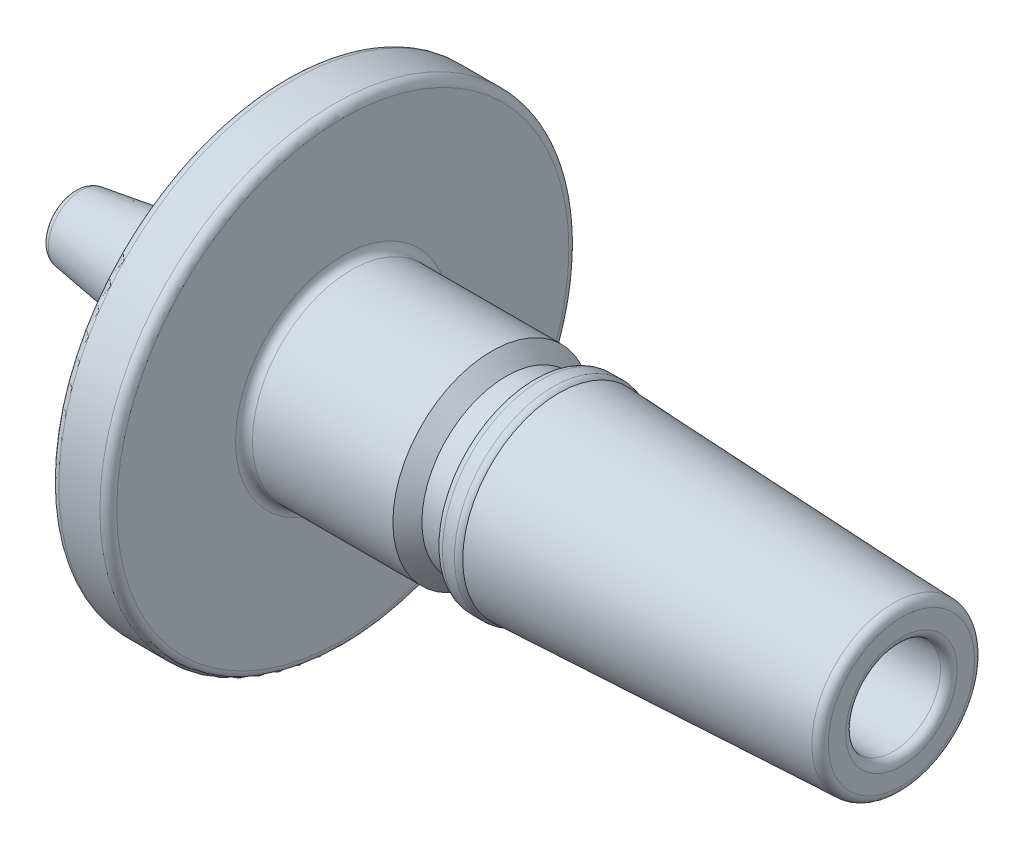
ISO-10303-21;
HEADER;
FILE_DESCRIPTION(('STEP AP214'),'2;1');
FILE_NAME('part.step','',(''),(''),'','','');
FILE_SCHEMA(('AUTOMOTIVE_DESIGN { 1 0 10303 214 1 1 1 1 }'));
ENDSEC;
DATA;
#1=APPLICATION_CONTEXT('core data for automotive mechanical design processes');
#2=APPLICATION_PROTOCOL_DEFINITION('international standard','automotive_design',2000,#1);
#3=PRODUCT_CONTEXT('',#1,'mechanical');
#4=PRODUCT('Part','Part','',(#3));
#5=PRODUCT_RELATED_PRODUCT_CATEGORY('part','',(#4));
#6=PRODUCT_DEFINITION_FORMATION('','',#4);
#7=PRODUCT_DEFINITION_CONTEXT('part definition',#1,'design');
#8=PRODUCT_DEFINITION('design','',#6,#7);
#9=PRODUCT_DEFINITION_SHAPE('','',#8);
#10=(LENGTH_UNIT() NAMED_UNIT(*) SI_UNIT(.MILLI.,.METRE.));
#11=(NAMED_UNIT(*) PLANE_ANGLE_UNIT() SI_UNIT($,.RADIAN.));
#12=(NAMED_UNIT(*) SI_UNIT($,.STERADIAN.) SOLID_ANGLE_UNIT());
#13=UNCERTAINTY_MEASURE_WITH_UNIT(LENGTH_MEASURE(1.E-05),#10,'distance_accuracy_value','');
#14=(GEOMETRIC_REPRESENTATION_CONTEXT(3) GLOBAL_UNCERTAINTY_ASSIGNED_CONTEXT((#13)) GLOBAL_UNIT_ASSIGNED_CONTEXT((#10,
#11,#12)) REPRESENTATION_CONTEXT('',''));
#15=CARTESIAN_POINT('',(0.,0.,0.));
#16=DIRECTION('',(0.,0.,1.));
#17=DIRECTION('',(1.,0.,0.));
#18=AXIS2_PLACEMENT_3D('',#15,#16,#17);
#19=CARTESIAN_POINT('',(1.397,0.,-0.635));
#20=DIRECTION('',(-1.,0.,0.));
#21=DIRECTION('',(0.,0.,1.));
#22=AXIS2_PLACEMENT_3D('',#19,#20,#21);
#23=PLANE('',#22);
#24=CARTESIAN_POINT('',(1.397,0.,0.));
#25=DIRECTION('',(-1.,0.,0.));
#26=DIRECTION('',(0.,0.,1.));
#27=AXIS2_PLACEMENT_3D('',#24,#25,#26);
#28=CIRCLE('',#27,0.908019915936334);
#29=CARTESIAN_POINT('',(1.397,0.,0.908019915936334));
#30=VERTEX_POINT('',#29);
#31=EDGE_CURVE('E109',#30,#30,#28,.T.);
#32=ORIENTED_EDGE('',*,*,#31,.F.);
#33=EDGE_LOOP('',(#32));
#34=FACE_BOUND('',#33,.T.);
#35=CARTESIAN_POINT('',(1.397,0.,0.));
#36=DIRECTION('',(-1.,0.,0.));
#37=DIRECTION('',(0.,0.,1.));
#38=AXIS2_PLACEMENT_3D('',#35,#36,#37);
#39=CIRCLE('',#38,0.635);
#40=CARTESIAN_POINT('',(1.397,0.,0.635));
#41=VERTEX_POINT('',#40);
#42=EDGE_CURVE('E133',#41,#41,#39,.T.);
#43=ORIENTED_EDGE('',*,*,#42,.T.);
#44=EDGE_LOOP('',(#43));
#45=FACE_BOUND('',#44,.T.);
#46=ADVANCED_FACE('F47',(#34,#45),#23,.F.);
#47=CARTESIAN_POINT('',(1.397,0.,0.));
#48=DIRECTION('',(1.,0.,0.));
#49=DIRECTION('',(0.,0.,-1.));
#50=AXIS2_PLACEMENT_3D('',#47,#48,#49);
#51=CONICAL_SURFACE('',#50,0.908019915936334,0.0174532925199434);
#52=CARTESIAN_POINT('',(14.659346328988,0.,0.));
#53=DIRECTION('',(-1.,0.,0.));
#54=DIRECTION('',(0.,0.,1.));
#55=AXIS2_PLACEMENT_3D('',#52,#53,#54);
#56=CIRCLE('',#55,1.13951503220933);
#57=CARTESIAN_POINT('',(14.659346328988,0.,1.13951503220933));
#58=VERTEX_POINT('',#57);
#59=EDGE_CURVE('E100',#58,#58,#56,.F.);
#60=ORIENTED_EDGE('',*,*,#59,.T.);
#61=EDGE_LOOP('',(#60));
#62=FACE_BOUND('',#61,.T.);
#63=ORIENTED_EDGE('',*,*,#31,.T.);
#64=EDGE_LOOP('',(#63));
#65=FACE_BOUND('',#64,.T.);
#66=ADVANCED_FACE('F164',(#62,#65),#51,.F.);
#67=CARTESIAN_POINT('',(14.859,0.,-1.143));
#68=DIRECTION('',(-1.,0.,0.));
#69=DIRECTION('',(0.,0.,1.));
#70=AXIS2_PLACEMENT_3D('',#67,#68,#69);
#71=PLANE('',#70);
#72=CARTESIAN_POINT('',(14.859,0.,0.));
#73=DIRECTION('',(-1.,0.,0.));
#74=DIRECTION('',(0.,0.,1.));
#75=AXIS2_PLACEMENT_3D('',#72,#73,#74);
#76=CIRCLE('',#75,1.34268408386511);
#77=CARTESIAN_POINT('',(14.859,0.,1.34268408386511));
#78=VERTEX_POINT('',#77);
#79=EDGE_CURVE('E103',#78,#78,#76,.T.);
#80=ORIENTED_EDGE('',*,*,#79,.T.);
#81=EDGE_LOOP('',(#80));
#82=FACE_BOUND('',#81,.T.);
#83=CARTESIAN_POINT('',(14.859,0.,0.));
#84=DIRECTION('',(-1.,0.,0.));
#85=DIRECTION('',(0.,0.,1.));
#86=AXIS2_PLACEMENT_3D('',#83,#84,#85);
#87=CIRCLE('',#86,1.76127831797382);
#88=CARTESIAN_POINT('',(14.859,0.,1.76127831797382));
#89=VERTEX_POINT('',#88);
#90=EDGE_CURVE('E106',#89,#89,#87,.F.);
#91=ORIENTED_EDGE('',*,*,#90,.T.);
#92=EDGE_LOOP('',(#91));
#93=FACE_BOUND('',#92,.T.);
#94=ADVANCED_FACE('F170',(#82,#93),#71,.F.);
#95=CARTESIAN_POINT('',(14.859,0.,0.));
#96=DIRECTION('',(-1.,0.,0.));
#97=DIRECTION('',(0.,0.,1.));
#98=AXIS2_PLACEMENT_3D('',#95,#96,#97);
#99=CONICAL_SURFACE('',#98,1.9558,0.043633231299851);
#100=CARTESIAN_POINT('',(14.6646634595126,0.,0.));
#101=DIRECTION('',(1.,0.,0.));
#102=DIRECTION('',(0.,0.,-1.));
#103=AXIS2_PLACEMENT_3D('',#100,#101,#102);
#104=CIRCLE('',#103,1.96428491659925);
#105=CARTESIAN_POINT('',(14.6646634595126,0.,-1.96428491659925));
#106=VERTEX_POINT('',#105);
#107=EDGE_CURVE('E88',#106,#106,#104,.F.);
#108=ORIENTED_EDGE('',*,*,#107,.T.);
#109=EDGE_LOOP('',(#108));
#110=FACE_BOUND('',#109,.T.);
#111=CARTESIAN_POINT('',(6.604,0.,0.));
#112=DIRECTION('',(-1.,0.,0.));
#113=DIRECTION('',(0.,0.,1.));
#114=AXIS2_PLACEMENT_3D('',#111,#112,#113);
#115=CIRCLE('',#114,2.31622108370971);
#116=CARTESIAN_POINT('',(6.604,0.,2.31622108370971));
#117=VERTEX_POINT('',#116);
#118=EDGE_CURVE('E112',#117,#117,#115,.T.);
#119=ORIENTED_EDGE('',*,*,#118,.F.);
#120=EDGE_LOOP('',(#119));
#121=FACE_BOUND('',#120,.T.);
#122=ADVANCED_FACE('F214',(#110,#121),#99,.T.);
#123=CARTESIAN_POINT('',(0.,0.,0.));
#124=DIRECTION('',(-1.,0.,0.));
#125=DIRECTION('',(0.,0.,1.));
#126=AXIS2_PLACEMENT_3D('',#123,#124,#125);
#127=CYLINDRICAL_SURFACE('',#126,2.3749);
#128=CARTESIAN_POINT('',(6.46115779208031,0.,0.));
#129=DIRECTION('',(1.,0.,0.));
#130=DIRECTION('',(0.,0.,-1.));
#131=AXIS2_PLACEMENT_3D('',#128,#129,#130);
#132=CIRCLE('',#131,2.3749);
#133=CARTESIAN_POINT('',(6.46115779208031,0.,-2.3749));
#134=VERTEX_POINT('',#133);
#135=EDGE_CURVE('E94',#134,#134,#132,.F.);
#136=ORIENTED_EDGE('',*,*,#135,.T.);
#137=EDGE_LOOP('',(#136));
#138=FACE_BOUND('',#137,.T.);
#139=CARTESIAN_POINT('',(6.1722,0.,0.));
#140=DIRECTION('',(1.,0.,0.));
#141=DIRECTION('',(0.,0.,-1.));
#142=AXIS2_PLACEMENT_3D('',#139,#140,#141);
#143=CIRCLE('',#142,2.3749);
#144=CARTESIAN_POINT('',(6.1722,0.,-2.3749));
#145=VERTEX_POINT('',#144);
#146=EDGE_CURVE('E97',#145,#145,#143,.T.);
#147=ORIENTED_EDGE('',*,*,#146,.T.);
#148=EDGE_LOOP('',(#147));
#149=FACE_BOUND('',#148,.T.);
#150=ADVANCED_FACE('F195',(#138,#149),#127,.T.);
#151=CARTESIAN_POINT('',(5.969,0.,-2.3749));
#152=DIRECTION('',(1.,0.,0.));
#153=DIRECTION('',(0.,0.,-1.));
#154=AXIS2_PLACEMENT_3D('',#151,#152,#153);
#155=PLANE('',#154);
#156=CARTESIAN_POINT('',(5.969,0.,0.));
#157=DIRECTION('',(1.,0.,0.));
#158=DIRECTION('',(0.,0.,-1.));
#159=AXIS2_PLACEMENT_3D('',#156,#157,#158);
#160=CIRCLE('',#159,2.1717);
#161=CARTESIAN_POINT('',(5.969,0.,-2.1717));
#162=VERTEX_POINT('',#161);
#163=EDGE_CURVE('E91',#162,#162,#160,.F.);
#164=ORIENTED_EDGE('',*,*,#163,.T.);
#165=EDGE_LOOP('',(#164));
#166=FACE_BOUND('',#165,.T.);
#167=CARTESIAN_POINT('',(5.969,0.,0.));
#168=DIRECTION('',(-1.,0.,0.));
#169=DIRECTION('',(0.,0.,1.));
#170=AXIS2_PLACEMENT_3D('',#167,#168,#169);
#171=CIRCLE('',#170,2.032);
#172=CARTESIAN_POINT('',(5.969,0.,2.032));
#173=VERTEX_POINT('',#172);
#174=EDGE_CURVE('E115',#173,#173,#171,.T.);
#175=ORIENTED_EDGE('',*,*,#174,.F.);
#176=EDGE_LOOP('',(#175));
#177=FACE_BOUND('',#176,.T.);
#178=ADVANCED_FACE('F191',(#166,#177),#155,.F.);
#179=CARTESIAN_POINT('',(0.,0.,0.));
#180=DIRECTION('',(-1.,0.,0.));
#181=DIRECTION('',(0.,0.,1.));
#182=AXIS2_PLACEMENT_3D('',#179,#180,#181);
#183=CYLINDRICAL_SURFACE('',#182,2.032);
#184=CARTESIAN_POINT('',(5.334,0.,0.));
#185=DIRECTION('',(-1.,0.,0.));
#186=DIRECTION('',(0.,0.,1.));
#187=AXIS2_PLACEMENT_3D('',#184,#185,#186);
#188=CIRCLE('',#187,2.032);
#189=CARTESIAN_POINT('',(5.334,0.,2.032));
#190=VERTEX_POINT('',#189);
#191=EDGE_CURVE('E118',#190,#190,#188,.T.);
#192=ORIENTED_EDGE('',*,*,#191,.F.);
#193=EDGE_LOOP('',(#192));
#194=FACE_BOUND('',#193,.T.);
#195=ORIENTED_EDGE('',*,*,#174,.T.);
#196=EDGE_LOOP('',(#195));
#197=FACE_BOUND('',#196,.T.);
#198=ADVANCED_FACE('F194',(#194,#197),#183,.T.);
#199=CARTESIAN_POINT('',(5.334,0.,0.));
#200=DIRECTION('',(-1.,0.,0.));
#201=DIRECTION('',(0.,0.,1.));
#202=AXIS2_PLACEMENT_3D('',#199,#200,#201);
#203=CONICAL_SURFACE('',#202,2.032,0.785398163397451);
#204=CARTESIAN_POINT('',(4.98475,0.,0.));
#205=DIRECTION('',(-1.,0.,0.));
#206=DIRECTION('',(0.,0.,1.));
#207=AXIS2_PLACEMENT_3D('',#204,#205,#206);
#208=CIRCLE('',#207,2.38125);
#209=CARTESIAN_POINT('',(4.98475,0.,2.38125));
#210=VERTEX_POINT('',#209);
#211=EDGE_CURVE('E121',#210,#210,#208,.T.);
#212=ORIENTED_EDGE('',*,*,#211,.F.);
#213=EDGE_LOOP('',(#212));
#214=FACE_BOUND('',#213,.T.);
#215=ORIENTED_EDGE('',*,*,#191,.T.);
#216=EDGE_LOOP('',(#215));
#217=FACE_BOUND('',#216,.T.);
#218=ADVANCED_FACE('F200',(#214,#217),#203,.T.);
#219=CARTESIAN_POINT('',(0.,0.,0.));
#220=DIRECTION('',(-1.,0.,0.));
#221=DIRECTION('',(0.,0.,1.));
#222=AXIS2_PLACEMENT_3D('',#219,#220,#221);
#223=CYLINDRICAL_SURFACE('',#222,2.38125);
#224=CARTESIAN_POINT('',(1.6002,0.,0.));
#225=DIRECTION('',(-1.,0.,0.));
#226=DIRECTION('',(0.,0.,1.));
#227=AXIS2_PLACEMENT_3D('',#224,#225,#226);
#228=CIRCLE('',#227,2.38125);
#229=CARTESIAN_POINT('',(1.6002,0.,2.38125));
#230=VERTEX_POINT('',#229);
#231=EDGE_CURVE('E12',#230,#230,#228,.F.);
#232=ORIENTED_EDGE('',*,*,#231,.T.);
#233=EDGE_LOOP('',(#232));
#234=FACE_BOUND('',#233,.T.);
#235=ORIENTED_EDGE('',*,*,#211,.T.);
#236=EDGE_LOOP('',(#235));
#237=FACE_BOUND('',#236,.T.);
#238=ADVANCED_FACE('F206',(#234,#237),#223,.T.);
#239=CARTESIAN_POINT('',(1.397,0.,-2.38125));
#240=DIRECTION('',(-1.,0.,0.));
#241=DIRECTION('',(0.,0.,1.));
#242=AXIS2_PLACEMENT_3D('',#239,#240,#241);
#243=PLANE('',#242);
#244=CARTESIAN_POINT('',(1.397,0.,0.));
#245=DIRECTION('',(-1.,0.,0.));
#246=DIRECTION('',(0.,0.,1.));
#247=AXIS2_PLACEMENT_3D('',#244,#245,#246);
#248=CIRCLE('',#247,2.58445);
#249=CARTESIAN_POINT('',(1.397,0.,2.58445));
#250=VERTEX_POINT('',#249);
#251=EDGE_CURVE('E54',#250,#250,#248,.T.);
#252=ORIENTED_EDGE('',*,*,#251,.T.);
#253=EDGE_LOOP('',(#252));
#254=FACE_BOUND('',#253,.T.);
#255=CARTESIAN_POINT('',(1.397,0.,0.));
#256=DIRECTION('',(-1.,0.,0.));
#257=DIRECTION('',(0.,0.,1.));
#258=AXIS2_PLACEMENT_3D('',#255,#256,#257);
#259=CIRCLE('',#258,5.4483);
#260=CARTESIAN_POINT('',(1.397,0.,5.4483));
#261=VERTEX_POINT('',#260);
#262=EDGE_CURVE('E58',#261,#261,#259,.F.);
#263=ORIENTED_EDGE('',*,*,#262,.T.);
#264=EDGE_LOOP('',(#263));
#265=FACE_BOUND('',#264,.T.);
#266=ADVANCED_FACE('F257',(#254,#265),#243,.F.);
#267=CARTESIAN_POINT('',(0.,0.,0.));
#268=DIRECTION('',(-1.,0.,0.));
#269=DIRECTION('',(0.,0.,1.));
#270=AXIS2_PLACEMENT_3D('',#267,#268,#269);
#271=CYLINDRICAL_SURFACE('',#270,5.6515);
#272=CARTESIAN_POINT('',(0.2032,0.,0.));
#273=DIRECTION('',(1.,0.,0.));
#274=DIRECTION('',(0.,0.,-1.));
#275=AXIS2_PLACEMENT_3D('',#272,#273,#274);
#276=CIRCLE('',#275,5.6515);
#277=CARTESIAN_POINT('',(0.2032,0.,-5.6515));
#278=VERTEX_POINT('',#277);
#279=EDGE_CURVE('E62',#278,#278,#276,.T.);
#280=ORIENTED_EDGE('',*,*,#279,.T.);
#281=EDGE_LOOP('',(#280));
#282=FACE_BOUND('',#281,.T.);
#283=CARTESIAN_POINT('',(1.1938,0.,0.));
#284=DIRECTION('',(-1.,0.,0.));
#285=DIRECTION('',(0.,0.,1.));
#286=AXIS2_PLACEMENT_3D('',#283,#284,#285);
#287=CIRCLE('',#286,5.6515);
#288=CARTESIAN_POINT('',(1.1938,0.,5.6515));
#289=VERTEX_POINT('',#288);
#290=EDGE_CURVE('E67',#289,#289,#287,.T.);
#291=ORIENTED_EDGE('',*,*,#290,.T.);
#292=EDGE_LOOP('',(#291));
#293=FACE_BOUND('',#292,.T.);
#294=ADVANCED_FACE('F266',(#282,#293),#271,.T.);
#295=CARTESIAN_POINT('',(0.,0.,-5.6515));
#296=DIRECTION('',(1.,0.,0.));
#297=DIRECTION('',(0.,0.,-1.));
#298=AXIS2_PLACEMENT_3D('',#295,#296,#297);
#299=PLANE('',#298);
#300=CARTESIAN_POINT('',(0.,0.,0.));
#301=DIRECTION('',(1.,0.,0.));
#302=DIRECTION('',(0.,0.,-1.));
#303=AXIS2_PLACEMENT_3D('',#300,#301,#302);
#304=CIRCLE('',#303,1.31799328390815);
#305=CARTESIAN_POINT('',(0.,0.,-1.31799328390815));
#306=VERTEX_POINT('',#305);
#307=EDGE_CURVE('E70',#306,#306,#304,.T.);
#308=ORIENTED_EDGE('',*,*,#307,.T.);
#309=EDGE_LOOP('',(#308));
#310=FACE_BOUND('',#309,.T.);
#311=CARTESIAN_POINT('',(0.,0.,0.));
#312=DIRECTION('',(1.,0.,0.));
#313=DIRECTION('',(0.,0.,-1.));
#314=AXIS2_PLACEMENT_3D('',#311,#312,#313);
#315=CIRCLE('',#314,5.4483);
#316=CARTESIAN_POINT('',(0.,0.,-5.4483));
#317=VERTEX_POINT('',#316);
#318=EDGE_CURVE('E73',#317,#317,#315,.F.);
#319=ORIENTED_EDGE('',*,*,#318,.T.);
#320=EDGE_LOOP('',(#319));
#321=FACE_BOUND('',#320,.T.);
#322=ADVANCED_FACE('F275',(#310,#321),#299,.F.);
#323=CARTESIAN_POINT('',(0.,0.,0.));
#324=DIRECTION('',(1.,0.,0.));
#325=DIRECTION('',(0.,0.,-1.));
#326=AXIS2_PLACEMENT_3D('',#323,#324,#325);
#327=CONICAL_SURFACE('',#326,1.143,0.148889947609497);
#328=CARTESIAN_POINT('',(-1.25501244601892,0.,0.));
#329=DIRECTION('',(1.,0.,0.));
#330=DIRECTION('',(0.,0.,-1.));
#331=AXIS2_PLACEMENT_3D('',#328,#329,#330);
#332=CIRCLE('',#331,0.954748133097162);
#333=CARTESIAN_POINT('',(-1.25501244601892,0.,-0.954748133097162));
#334=VERTEX_POINT('',#333);
#335=EDGE_CURVE('E76',#334,#334,#332,.T.);
#336=ORIENTED_EDGE('',*,*,#335,.T.);
#337=EDGE_LOOP('',(#336));
#338=FACE_BOUND('',#337,.T.);
#339=CARTESIAN_POINT('',(-0.173057219964574,0.,0.));
#340=DIRECTION('',(1.,0.,0.));
#341=DIRECTION('',(0.,0.,-1.));
#342=AXIS2_PLACEMENT_3D('',#339,#340,#341);
#343=CIRCLE('',#342,1.11704141700531);
#344=CARTESIAN_POINT('',(-0.173057219964574,0.,-1.11704141700531));
#345=VERTEX_POINT('',#344);
#346=EDGE_CURVE('E79',#345,#345,#343,.F.);
#347=ORIENTED_EDGE('',*,*,#346,.T.);
#348=EDGE_LOOP('',(#347));
#349=FACE_BOUND('',#348,.T.);
#350=ADVANCED_FACE('F285',(#338,#349),#327,.T.);
#351=CARTESIAN_POINT('',(0.,0.,0.));
#352=DIRECTION('',(-1.,0.,0.));
#353=DIRECTION('',(0.,0.,1.));
#354=AXIS2_PLACEMENT_3D('',#351,#352,#353);
#355=CYLINDRICAL_SURFACE('',#354,0.9525);
#356=CARTESIAN_POINT('',(-1.28515522605435,0.,0.));
#357=DIRECTION('',(-1.,0.,0.));
#358=DIRECTION('',(0.,0.,1.));
#359=AXIS2_PLACEMENT_3D('',#356,#357,#358);
#360=CIRCLE('',#359,0.9525);
#361=CARTESIAN_POINT('',(-1.28515522605435,0.,0.9525));
#362=VERTEX_POINT('',#361);
#363=EDGE_CURVE('E82',#362,#362,#360,.T.);
#364=ORIENTED_EDGE('',*,*,#363,.T.);
#365=EDGE_LOOP('',(#364));
#366=FACE_BOUND('',#365,.T.);
#367=CARTESIAN_POINT('',(-2.54,0.,0.));
#368=DIRECTION('',(-1.,0.,0.));
#369=DIRECTION('',(0.,0.,1.));
#370=AXIS2_PLACEMENT_3D('',#367,#368,#369);
#371=CIRCLE('',#370,0.9525);
#372=CARTESIAN_POINT('',(-2.54,0.,0.9525));
#373=VERTEX_POINT('',#372);
#374=EDGE_CURVE('E124',#373,#373,#371,.T.);
#375=ORIENTED_EDGE('',*,*,#374,.F.);
#376=EDGE_LOOP('',(#375));
#377=FACE_BOUND('',#376,.T.);
#378=ADVANCED_FACE('F295',(#366,#377),#355,.T.);
#379=CARTESIAN_POINT('',(-2.54,0.,-0.9525));
#380=DIRECTION('',(-1.,0.,0.));
#381=DIRECTION('',(0.,0.,1.));
#382=AXIS2_PLACEMENT_3D('',#379,#380,#381);
#383=PLANE('',#382);
#384=CARTESIAN_POINT('',(-2.54,0.,0.));
#385=DIRECTION('',(-1.,0.,0.));
#386=DIRECTION('',(0.,0.,1.));
#387=AXIS2_PLACEMENT_3D('',#384,#385,#386);
#388=CIRCLE('',#387,1.143);
#389=CARTESIAN_POINT('',(-2.54,0.,1.143));
#390=VERTEX_POINT('',#389);
#391=EDGE_CURVE('E127',#390,#390,#388,.T.);
#392=ORIENTED_EDGE('',*,*,#391,.F.);
#393=EDGE_LOOP('',(#392));
#394=FACE_BOUND('',#393,.T.);
#395=ORIENTED_EDGE('',*,*,#374,.T.);
#396=EDGE_LOOP('',(#395));
#397=FACE_BOUND('',#396,.T.);
#398=ADVANCED_FACE('F305',(#394,#397),#383,.F.);
#399=CARTESIAN_POINT('',(-2.54,0.,0.));
#400=DIRECTION('',(1.,0.,0.));
#401=DIRECTION('',(0.,0.,-1.));
#402=AXIS2_PLACEMENT_3D('',#399,#400,#401);
#403=CONICAL_SURFACE('',#402,1.143,0.148889947609497);
#404=CARTESIAN_POINT('',(-4.9129115848947,0.,0.));
#405=DIRECTION('',(-1.,0.,0.));
#406=DIRECTION('',(0.,0.,1.));
#407=AXIS2_PLACEMENT_3D('',#404,#405,#406);
#408=CIRCLE('',#407,0.787063262265795);
#409=CARTESIAN_POINT('',(-4.9129115848947,0.,0.787063262265795));
#410=VERTEX_POINT('',#409);
#411=EDGE_CURVE('E85',#410,#410,#408,.F.);
#412=ORIENTED_EDGE('',*,*,#411,.T.);
#413=EDGE_LOOP('',(#412));
#414=FACE_BOUND('',#413,.T.);
#415=ORIENTED_EDGE('',*,*,#391,.T.);
#416=EDGE_LOOP('',(#415));
#417=FACE_BOUND('',#416,.T.);
#418=ADVANCED_FACE('F142',(#414,#417),#403,.T.);
#419=CARTESIAN_POINT('',(0.,0.,0.));
#420=DIRECTION('',(-1.,0.,0.));
#421=DIRECTION('',(0.,0.,1.));
#422=AXIS2_PLACEMENT_3D('',#419,#420,#421);
#423=CYLINDRICAL_SURFACE('',#422,0.635);
#424=ORIENTED_EDGE('',*,*,#42,.F.);
#425=EDGE_LOOP('',(#424));
#426=FACE_BOUND('',#425,.T.);
#427=CARTESIAN_POINT('',(-5.08,0.,0.));
#428=DIRECTION('',(-1.,0.,0.));
#429=DIRECTION('',(0.,0.,1.));
#430=AXIS2_PLACEMENT_3D('',#427,#428,#429);
#431=CIRCLE('',#430,0.635);
#432=CARTESIAN_POINT('',(-5.08,0.,0.635));
#433=VERTEX_POINT('',#432);
#434=EDGE_CURVE('E130',#433,#433,#431,.T.);
#435=ORIENTED_EDGE('',*,*,#434,.T.);
#436=EDGE_LOOP('',(#435));
#437=FACE_BOUND('',#436,.T.);
#438=ADVANCED_FACE('F138',(#426,#437),#423,.F.);
#439=CARTESIAN_POINT('',(14.6558,0.,0.));
#440=DIRECTION('',(-1.,0.,0.));
#441=DIRECTION('',(0.,0.,1.));
#442=AXIS2_PLACEMENT_3D('',#439,#440,#441);
#443=TOROIDAL_SURFACE('',#442,1.34268408386511,0.2032);
#444=ORIENTED_EDGE('',*,*,#59,.F.);
#445=EDGE_LOOP('',(#444));
#446=FACE_BOUND('',#445,.T.);
#447=ORIENTED_EDGE('',*,*,#79,.F.);
#448=EDGE_LOOP('',(#447));
#449=FACE_BOUND('',#448,.T.);
#450=ADVANCED_FACE('F141',(#446,#449),#443,.T.);
#451=CARTESIAN_POINT('',(6.46115779208031,0.,0.));
#452=DIRECTION('',(1.,0.,0.));
#453=DIRECTION('',(0.,0.,-1.));
#454=AXIS2_PLACEMENT_3D('',#451,#452,#453);
#455=TOROIDAL_SURFACE('',#454,2.1717,0.2032);
#456=ORIENTED_EDGE('',*,*,#118,.T.);
#457=EDGE_LOOP('',(#456));
#458=FACE_BOUND('',#457,.T.);
#459=ORIENTED_EDGE('',*,*,#135,.F.);
#460=EDGE_LOOP('',(#459));
#461=FACE_BOUND('',#460,.T.);
#462=ADVANCED_FACE('F178',(#458,#461),#455,.T.);
#463=CARTESIAN_POINT('',(6.1722,0.,0.));
#464=DIRECTION('',(1.,0.,0.));
#465=DIRECTION('',(0.,0.,-1.));
#466=AXIS2_PLACEMENT_3D('',#463,#464,#465);
#467=TOROIDAL_SURFACE('',#466,2.1717,0.2032);
#468=ORIENTED_EDGE('',*,*,#146,.F.);
#469=EDGE_LOOP('',(#468));
#470=FACE_BOUND('',#469,.T.);
#471=ORIENTED_EDGE('',*,*,#163,.F.);
#472=EDGE_LOOP('',(#471));
#473=FACE_BOUND('',#472,.T.);
#474=ADVANCED_FACE('F159',(#470,#473),#467,.T.);
#475=CARTESIAN_POINT('',(14.6558,0.,0.));
#476=DIRECTION('',(-1.,0.,0.));
#477=DIRECTION('',(0.,0.,1.));
#478=AXIS2_PLACEMENT_3D('',#475,#476,#477);
#479=TOROIDAL_SURFACE('',#478,1.76127831797382,0.2032);
#480=ORIENTED_EDGE('',*,*,#90,.F.);
#481=EDGE_LOOP('',(#480));
#482=FACE_BOUND('',#481,.T.);
#483=ORIENTED_EDGE('',*,*,#107,.F.);
#484=EDGE_LOOP('',(#483));
#485=FACE_BOUND('',#484,.T.);
#486=ADVANCED_FACE('F149',(#482,#485),#479,.T.);
#487=CARTESIAN_POINT('',(-4.88276880485927,0.,0.));
#488=DIRECTION('',(-1.,0.,0.));
#489=DIRECTION('',(0.,0.,1.));
#490=AXIS2_PLACEMENT_3D('',#487,#488,#489);
#491=TOROIDAL_SURFACE('',#490,0.586111395362957,0.2032);
#492=ORIENTED_EDGE('',*,*,#411,.F.);
#493=EDGE_LOOP('',(#492));
#494=FACE_BOUND('',#493,.T.);
#495=ORIENTED_EDGE('',*,*,#434,.F.);
#496=EDGE_LOOP('',(#495));
#497=FACE_BOUND('',#496,.T.);
#498=ADVANCED_FACE('F146',(#494,#497),#491,.T.);
#499=CARTESIAN_POINT('',(-1.28515522605435,0.,0.));
#500=DIRECTION('',(-1.,0.,0.));
#501=DIRECTION('',(0.,0.,1.));
#502=AXIS2_PLACEMENT_3D('',#499,#500,#501);
#503=TOROIDAL_SURFACE('',#502,1.1557,0.2032);
#504=ORIENTED_EDGE('',*,*,#335,.F.);
#505=EDGE_LOOP('',(#504));
#506=FACE_BOUND('',#505,.T.);
#507=ORIENTED_EDGE('',*,*,#363,.F.);
#508=EDGE_LOOP('',(#507));
#509=FACE_BOUND('',#508,.T.);
#510=ADVANCED_FACE('F148',(#506,#509),#503,.F.);
#511=CARTESIAN_POINT('',(-0.2032,0.,0.));
#512=DIRECTION('',(1.,0.,0.));
#513=DIRECTION('',(0.,0.,-1.));
#514=AXIS2_PLACEMENT_3D('',#511,#512,#513);
#515=TOROIDAL_SURFACE('',#514,1.31799328390815,0.2032);
#516=ORIENTED_EDGE('',*,*,#307,.F.);
#517=EDGE_LOOP('',(#516));
#518=FACE_BOUND('',#517,.T.);
#519=ORIENTED_EDGE('',*,*,#346,.F.);
#520=EDGE_LOOP('',(#519));
#521=FACE_BOUND('',#520,.T.);
#522=ADVANCED_FACE('F156',(#518,#521),#515,.F.);
#523=CARTESIAN_POINT('',(0.2032,0.,0.));
#524=DIRECTION('',(1.,0.,0.));
#525=DIRECTION('',(0.,0.,-1.));
#526=AXIS2_PLACEMENT_3D('',#523,#524,#525);
#527=TOROIDAL_SURFACE('',#526,5.4483,0.2032);
#528=ORIENTED_EDGE('',*,*,#279,.F.);
#529=EDGE_LOOP('',(#528));
#530=FACE_BOUND('',#529,.T.);
#531=ORIENTED_EDGE('',*,*,#318,.F.);
#532=EDGE_LOOP('',(#531));
#533=FACE_BOUND('',#532,.T.);
#534=ADVANCED_FACE('F359',(#530,#533),#527,.T.);
#535=CARTESIAN_POINT('',(1.6002,0.,0.));
#536=DIRECTION('',(-1.,0.,0.));
#537=DIRECTION('',(0.,0.,1.));
#538=AXIS2_PLACEMENT_3D('',#535,#536,#537);
#539=TOROIDAL_SURFACE('',#538,2.58445,0.2032);
#540=ORIENTED_EDGE('',*,*,#231,.F.);
#541=EDGE_LOOP('',(#540));
#542=FACE_BOUND('',#541,.T.);
#543=ORIENTED_EDGE('',*,*,#251,.F.);
#544=EDGE_LOOP('',(#543));
#545=FACE_BOUND('',#544,.T.);
#546=ADVANCED_FACE('F369',(#542,#545),#539,.F.);
#547=CARTESIAN_POINT('',(1.1938,0.,0.));
#548=DIRECTION('',(-1.,0.,0.));
#549=DIRECTION('',(0.,0.,1.));
#550=AXIS2_PLACEMENT_3D('',#547,#548,#549);
#551=TOROIDAL_SURFACE('',#550,5.4483,0.2032);
#552=ORIENTED_EDGE('',*,*,#262,.F.);
#553=EDGE_LOOP('',(#552));
#554=FACE_BOUND('',#553,.T.);
#555=ORIENTED_EDGE('',*,*,#290,.F.);
#556=EDGE_LOOP('',(#555));
#557=FACE_BOUND('',#556,.T.);
#558=ADVANCED_FACE('F49',(#554,#557),#551,.T.);
#559=CLOSED_SHELL('',(#46,#66,#94,#122,#150,#178,#198,#218,#238,#266,#294,#322,#350,#378,#398,
#418,#438,#450,#462,#474,#486,#498,#510,#522,#534,#546,#558));
#560=MANIFOLD_SOLID_BREP('B2',#559);
#561=ADVANCED_BREP_SHAPE_REPRESENTATION('',(#18,#560),#14);
#562=SHAPE_DEFINITION_REPRESENTATION(#9,#561);
ENDSEC;
END-ISO-10303-21;
